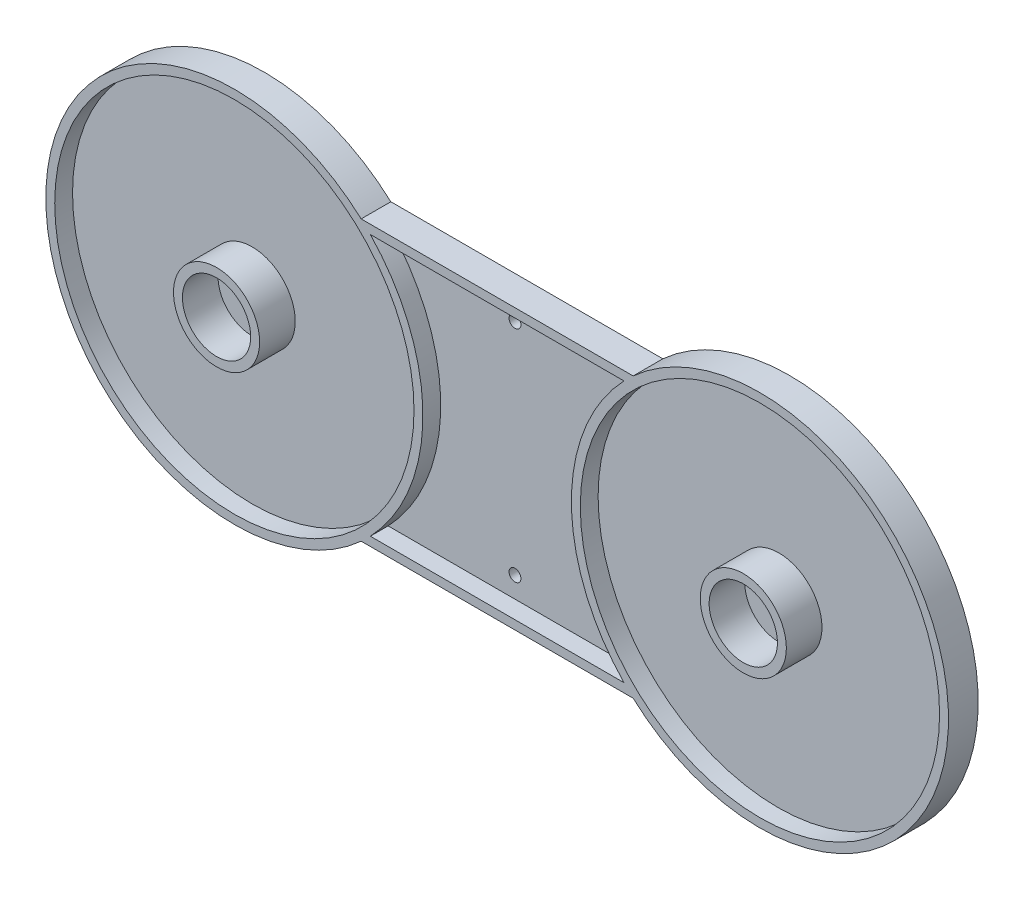
ISO-10303-21;
HEADER;
FILE_DESCRIPTION(('STEP AP214'),'2;1');
FILE_NAME('part.step','',(''),(''),'','','');
FILE_SCHEMA(('AUTOMOTIVE_DESIGN { 1 0 10303 214 1 1 1 1 }'));
ENDSEC;
DATA;
#1=APPLICATION_CONTEXT('core data for automotive mechanical design processes');
#2=APPLICATION_PROTOCOL_DEFINITION('international standard','automotive_design',2000,#1);
#3=PRODUCT_CONTEXT('',#1,'mechanical');
#4=PRODUCT('Part','Part','',(#3));
#5=PRODUCT_RELATED_PRODUCT_CATEGORY('part','',(#4));
#6=PRODUCT_DEFINITION_FORMATION('','',#4);
#7=PRODUCT_DEFINITION_CONTEXT('part definition',#1,'design');
#8=PRODUCT_DEFINITION('design','',#6,#7);
#9=PRODUCT_DEFINITION_SHAPE('','',#8);
#10=(LENGTH_UNIT() NAMED_UNIT(*) SI_UNIT(.MILLI.,.METRE.));
#11=(NAMED_UNIT(*) PLANE_ANGLE_UNIT() SI_UNIT($,.RADIAN.));
#12=(NAMED_UNIT(*) SI_UNIT($,.STERADIAN.) SOLID_ANGLE_UNIT());
#13=UNCERTAINTY_MEASURE_WITH_UNIT(LENGTH_MEASURE(1.E-05),#10,'distance_accuracy_value','');
#14=(GEOMETRIC_REPRESENTATION_CONTEXT(3) GLOBAL_UNCERTAINTY_ASSIGNED_CONTEXT((#13)) GLOBAL_UNIT_ASSIGNED_CONTEXT((#10,
#11,#12)) REPRESENTATION_CONTEXT('',''));
#15=CARTESIAN_POINT('',(0.,0.,0.));
#16=DIRECTION('',(0.,0.,1.));
#17=DIRECTION('',(1.,0.,0.));
#18=AXIS2_PLACEMENT_3D('',#15,#16,#17);
#19=CARTESIAN_POINT('',(44.25,0.,2.));
#20=DIRECTION('',(0.,0.,-1.));
#21=DIRECTION('',(-1.,0.,0.));
#22=AXIS2_PLACEMENT_3D('',#19,#20,#21);
#23=CYLINDRICAL_SURFACE('',#22,31.75);
#24=CARTESIAN_POINT('',(44.25,0.,0.));
#25=DIRECTION('',(0.,0.,1.));
#26=DIRECTION('',(1.,0.,0.));
#27=AXIS2_PLACEMENT_3D('',#24,#25,#26);
#28=CIRCLE('',#27,31.75);
#29=CARTESIAN_POINT('',(22.9002341933219,-23.5,0.));
#30=VERTEX_POINT('',#29);
#31=CARTESIAN_POINT('',(22.9002341933219,23.5,0.));
#32=VERTEX_POINT('',#31);
#33=EDGE_CURVE('E179',#30,#32,#28,.T.);
#34=ORIENTED_EDGE('',*,*,#33,.T.);
#35=DIRECTION('',(0.,0.,-1.));
#36=VECTOR('',#35,1.);
#37=CARTESIAN_POINT('',(22.9002341933219,23.5,2.));
#38=LINE('',#37,#36);
#39=CARTESIAN_POINT('',(22.9002341933219,23.5,5.));
#40=VERTEX_POINT('',#39);
#41=EDGE_CURVE('E204',#40,#32,#38,.T.);
#42=ORIENTED_EDGE('',*,*,#41,.F.);
#43=CARTESIAN_POINT('',(44.25,0.,5.));
#44=DIRECTION('',(0.,0.,1.));
#45=DIRECTION('',(1.,0.,0.));
#46=AXIS2_PLACEMENT_3D('',#43,#44,#45);
#47=CIRCLE('',#46,31.75);
#48=CARTESIAN_POINT('',(22.9002341933219,-23.5,5.));
#49=VERTEX_POINT('',#48);
#50=EDGE_CURVE('E163',#49,#40,#47,.T.);
#51=ORIENTED_EDGE('',*,*,#50,.F.);
#52=DIRECTION('',(0.,0.,-1.));
#53=VECTOR('',#52,1.);
#54=CARTESIAN_POINT('',(22.9002341933219,-23.5,2.));
#55=LINE('',#54,#53);
#56=EDGE_CURVE('E192',#49,#30,#55,.T.);
#57=ORIENTED_EDGE('',*,*,#56,.T.);
#58=EDGE_LOOP('',(#34,#42,#51,#57));
#59=FACE_BOUND('',#58,.T.);
#60=ADVANCED_FACE('F39',(#59),#23,.T.);
#61=CARTESIAN_POINT('',(22.9002341933219,23.5,2.));
#62=DIRECTION('',(0.,-1.,0.));
#63=DIRECTION('',(0.,0.,-1.));
#64=AXIS2_PLACEMENT_3D('',#61,#62,#63);
#65=PLANE('',#64);
#66=DIRECTION('',(-1.,0.,0.));
#67=VECTOR('',#66,1.);
#68=CARTESIAN_POINT('',(22.9002341933219,23.5,0.));
#69=LINE('',#68,#67);
#70=CARTESIAN_POINT('',(-22.9002341933219,23.5,0.));
#71=VERTEX_POINT('',#70);
#72=EDGE_CURVE('E183',#32,#71,#69,.T.);
#73=ORIENTED_EDGE('',*,*,#72,.T.);
#74=DIRECTION('',(0.,0.,-1.));
#75=VECTOR('',#74,1.);
#76=CARTESIAN_POINT('',(-22.9002341933219,23.5,2.));
#77=LINE('',#76,#75);
#78=CARTESIAN_POINT('',(-22.9002341933219,23.5,5.));
#79=VERTEX_POINT('',#78);
#80=EDGE_CURVE('E200',#79,#71,#77,.T.);
#81=ORIENTED_EDGE('',*,*,#80,.F.);
#82=DIRECTION('',(-1.,0.,0.));
#83=VECTOR('',#82,1.);
#84=CARTESIAN_POINT('',(22.9002341933219,23.5,5.));
#85=LINE('',#84,#83);
#86=EDGE_CURVE('E167',#40,#79,#85,.T.);
#87=ORIENTED_EDGE('',*,*,#86,.F.);
#88=ORIENTED_EDGE('',*,*,#41,.T.);
#89=EDGE_LOOP('',(#73,#81,#87,#88));
#90=FACE_BOUND('',#89,.T.);
#91=ADVANCED_FACE('F285',(#90),#65,.F.);
#92=CARTESIAN_POINT('',(-44.25,0.,2.));
#93=DIRECTION('',(0.,0.,-1.));
#94=DIRECTION('',(-1.,0.,0.));
#95=AXIS2_PLACEMENT_3D('',#92,#93,#94);
#96=CYLINDRICAL_SURFACE('',#95,31.75);
#97=CARTESIAN_POINT('',(-44.25,0.,0.));
#98=DIRECTION('',(0.,0.,1.));
#99=DIRECTION('',(1.,0.,0.));
#100=AXIS2_PLACEMENT_3D('',#97,#98,#99);
#101=CIRCLE('',#100,31.75);
#102=CARTESIAN_POINT('',(-22.9002341933219,-23.5,0.));
#103=VERTEX_POINT('',#102);
#104=EDGE_CURVE('E186',#71,#103,#101,.T.);
#105=ORIENTED_EDGE('',*,*,#104,.T.);
#106=DIRECTION('',(0.,0.,-1.));
#107=VECTOR('',#106,1.);
#108=CARTESIAN_POINT('',(-22.9002341933219,-23.5,2.));
#109=LINE('',#108,#107);
#110=CARTESIAN_POINT('',(-22.9002341933219,-23.5,5.));
#111=VERTEX_POINT('',#110);
#112=EDGE_CURVE('E196',#111,#103,#109,.T.);
#113=ORIENTED_EDGE('',*,*,#112,.F.);
#114=CARTESIAN_POINT('',(-44.25,0.,5.));
#115=DIRECTION('',(0.,0.,1.));
#116=DIRECTION('',(1.,0.,0.));
#117=AXIS2_PLACEMENT_3D('',#114,#115,#116);
#118=CIRCLE('',#117,31.75);
#119=EDGE_CURVE('E171',#79,#111,#118,.T.);
#120=ORIENTED_EDGE('',*,*,#119,.F.);
#121=ORIENTED_EDGE('',*,*,#80,.T.);
#122=EDGE_LOOP('',(#105,#113,#120,#121));
#123=FACE_BOUND('',#122,.T.);
#124=ADVANCED_FACE('F290',(#123),#96,.T.);
#125=CARTESIAN_POINT('',(22.9002341933219,-23.5,2.));
#126=DIRECTION('',(0.,1.,0.));
#127=DIRECTION('',(-1.,0.,0.));
#128=AXIS2_PLACEMENT_3D('',#125,#126,#127);
#129=PLANE('',#128);
#130=DIRECTION('',(1.,0.,0.));
#131=VECTOR('',#130,1.);
#132=CARTESIAN_POINT('',(22.9002341933219,-23.5,0.));
#133=LINE('',#132,#131);
#134=EDGE_CURVE('E189',#103,#30,#133,.T.);
#135=ORIENTED_EDGE('',*,*,#134,.T.);
#136=ORIENTED_EDGE('',*,*,#56,.F.);
#137=DIRECTION('',(1.,0.,0.));
#138=VECTOR('',#137,1.);
#139=CARTESIAN_POINT('',(-22.9002341933219,-23.5,5.));
#140=LINE('',#139,#138);
#141=EDGE_CURVE('E175',#111,#49,#140,.T.);
#142=ORIENTED_EDGE('',*,*,#141,.F.);
#143=ORIENTED_EDGE('',*,*,#112,.T.);
#144=EDGE_LOOP('',(#135,#136,#142,#143));
#145=FACE_BOUND('',#144,.T.);
#146=ADVANCED_FACE('F303',(#145),#129,.F.);
#147=CARTESIAN_POINT('',(44.25,0.,0.));
#148=DIRECTION('',(0.,0.,1.));
#149=DIRECTION('',(1.,0.,0.));
#150=AXIS2_PLACEMENT_3D('',#147,#148,#149);
#151=PLANE('',#150);
#152=CARTESIAN_POINT('',(0.,18.5,0.));
#153=DIRECTION('',(0.,0.,1.));
#154=DIRECTION('',(1.,0.,0.));
#155=AXIS2_PLACEMENT_3D('',#152,#153,#154);
#156=CIRCLE('',#155,1.);
#157=CARTESIAN_POINT('',(1.,18.5,0.));
#158=VERTEX_POINT('',#157);
#159=EDGE_CURVE('E221',#158,#158,#156,.T.);
#160=ORIENTED_EDGE('',*,*,#159,.T.);
#161=EDGE_LOOP('',(#160));
#162=FACE_BOUND('',#161,.T.);
#163=CARTESIAN_POINT('',(0.,-18.5,0.));
#164=DIRECTION('',(0.,0.,1.));
#165=DIRECTION('',(-1.,0.,0.));
#166=AXIS2_PLACEMENT_3D('',#163,#164,#165);
#167=CIRCLE('',#166,1.);
#168=CARTESIAN_POINT('',(-1.,-18.5,0.));
#169=VERTEX_POINT('',#168);
#170=EDGE_CURVE('E229',#169,#169,#167,.T.);
#171=ORIENTED_EDGE('',*,*,#170,.T.);
#172=EDGE_LOOP('',(#171));
#173=FACE_BOUND('',#172,.T.);
#174=ORIENTED_EDGE('',*,*,#33,.F.);
#175=ORIENTED_EDGE('',*,*,#134,.F.);
#176=ORIENTED_EDGE('',*,*,#104,.F.);
#177=ORIENTED_EDGE('',*,*,#72,.F.);
#178=EDGE_LOOP('',(#174,#175,#176,#177));
#179=FACE_BOUND('',#178,.T.);
#180=ADVANCED_FACE('F281',(#162,#173,#179),#151,.F.);
#181=CARTESIAN_POINT('',(44.25,0.,5.));
#182=DIRECTION('',(0.,0.,1.));
#183=DIRECTION('',(1.,0.,0.));
#184=AXIS2_PLACEMENT_3D('',#181,#182,#183);
#185=PLANE('',#184);
#186=CARTESIAN_POINT('',(-44.25,0.,5.));
#187=DIRECTION('',(0.,0.,1.));
#188=DIRECTION('',(1.,0.,0.));
#189=AXIS2_PLACEMENT_3D('',#186,#187,#188);
#190=CIRCLE('',#189,30.25);
#191=CARTESIAN_POINT('',(-14.,0.,5.));
#192=VERTEX_POINT('',#191);
#193=EDGE_CURVE('E159',#192,#192,#190,.T.);
#194=ORIENTED_EDGE('',*,*,#193,.F.);
#195=EDGE_LOOP('',(#194));
#196=FACE_BOUND('',#195,.T.);
#197=ORIENTED_EDGE('',*,*,#50,.T.);
#198=ORIENTED_EDGE('',*,*,#86,.T.);
#199=ORIENTED_EDGE('',*,*,#119,.T.);
#200=ORIENTED_EDGE('',*,*,#141,.T.);
#201=EDGE_LOOP('',(#197,#198,#199,#200));
#202=FACE_BOUND('',#201,.T.);
#203=CARTESIAN_POINT('',(44.25,0.,5.));
#204=DIRECTION('',(0.,0.,1.));
#205=DIRECTION('',(1.,0.,0.));
#206=AXIS2_PLACEMENT_3D('',#203,#204,#205);
#207=CIRCLE('',#206,30.25);
#208=CARTESIAN_POINT('',(74.5,0.,5.));
#209=VERTEX_POINT('',#208);
#210=EDGE_CURVE('E122',#209,#209,#207,.T.);
#211=ORIENTED_EDGE('',*,*,#210,.F.);
#212=EDGE_LOOP('',(#211));
#213=FACE_BOUND('',#212,.T.);
#214=DIRECTION('',(-1.,0.,0.));
#215=VECTOR('',#214,1.);
#216=CARTESIAN_POINT('',(-21.3575885935972,22.,5.));
#217=LINE('',#216,#215);
#218=CARTESIAN_POINT('',(21.3575885935972,22.,5.));
#219=VERTEX_POINT('',#218);
#220=CARTESIAN_POINT('',(-21.3575885935972,22.,5.));
#221=VERTEX_POINT('',#220);
#222=EDGE_CURVE('E115',#219,#221,#217,.T.);
#223=ORIENTED_EDGE('',*,*,#222,.F.);
#224=CARTESIAN_POINT('',(44.25,0.,5.));
#225=DIRECTION('',(0.,0.,-1.));
#226=DIRECTION('',(1.,0.,0.));
#227=AXIS2_PLACEMENT_3D('',#224,#225,#226);
#228=CIRCLE('',#227,31.75);
#229=CARTESIAN_POINT('',(21.3575885935972,-22.,5.));
#230=VERTEX_POINT('',#229);
#231=EDGE_CURVE('E105',#230,#219,#228,.T.);
#232=ORIENTED_EDGE('',*,*,#231,.F.);
#233=DIRECTION('',(1.,0.,0.));
#234=VECTOR('',#233,1.);
#235=CARTESIAN_POINT('',(-21.3575885935972,-22.,5.));
#236=LINE('',#235,#234);
#237=CARTESIAN_POINT('',(-21.3575885935972,-22.,5.));
#238=VERTEX_POINT('',#237);
#239=EDGE_CURVE('E132',#238,#230,#236,.T.);
#240=ORIENTED_EDGE('',*,*,#239,.F.);
#241=CARTESIAN_POINT('',(-44.25,0.,5.));
#242=DIRECTION('',(0.,0.,-1.));
#243=DIRECTION('',(1.,0.,0.));
#244=AXIS2_PLACEMENT_3D('',#241,#242,#243);
#245=CIRCLE('',#244,31.75);
#246=EDGE_CURVE('E128',#221,#238,#245,.T.);
#247=ORIENTED_EDGE('',*,*,#246,.F.);
#248=EDGE_LOOP('',(#223,#232,#240,#247));
#249=FACE_BOUND('',#248,.T.);
#250=ADVANCED_FACE('F126',(#196,#202,#213,#249),#185,.T.);
#251=CARTESIAN_POINT('',(-44.25,0.,5.));
#252=DIRECTION('',(0.,0.,-1.));
#253=DIRECTION('',(-1.,0.,0.));
#254=AXIS2_PLACEMENT_3D('',#251,#252,#253);
#255=CYLINDRICAL_SURFACE('',#254,30.25);
#256=ORIENTED_EDGE('',*,*,#193,.T.);
#257=EDGE_LOOP('',(#256));
#258=FACE_BOUND('',#257,.T.);
#259=CARTESIAN_POINT('',(-44.25,0.,2.));
#260=DIRECTION('',(0.,0.,1.));
#261=DIRECTION('',(1.,0.,0.));
#262=AXIS2_PLACEMENT_3D('',#259,#260,#261);
#263=CIRCLE('',#262,30.25);
#264=CARTESIAN_POINT('',(-14.,0.,2.));
#265=VERTEX_POINT('',#264);
#266=EDGE_CURVE('E212',#265,#265,#263,.F.);
#267=ORIENTED_EDGE('',*,*,#266,.T.);
#268=EDGE_LOOP('',(#267));
#269=FACE_BOUND('',#268,.T.);
#270=ADVANCED_FACE('F270',(#258,#269),#255,.F.);
#271=CARTESIAN_POINT('',(44.25,0.,5.));
#272=DIRECTION('',(0.,0.,-1.));
#273=DIRECTION('',(-1.,0.,0.));
#274=AXIS2_PLACEMENT_3D('',#271,#272,#273);
#275=CYLINDRICAL_SURFACE('',#274,30.25);
#276=ORIENTED_EDGE('',*,*,#210,.T.);
#277=EDGE_LOOP('',(#276));
#278=FACE_BOUND('',#277,.T.);
#279=CARTESIAN_POINT('',(44.25,0.,2.));
#280=DIRECTION('',(0.,0.,1.));
#281=DIRECTION('',(1.,0.,0.));
#282=AXIS2_PLACEMENT_3D('',#279,#280,#281);
#283=CIRCLE('',#282,30.25);
#284=CARTESIAN_POINT('',(74.5,0.,2.));
#285=VERTEX_POINT('',#284);
#286=EDGE_CURVE('E208',#285,#285,#283,.F.);
#287=ORIENTED_EDGE('',*,*,#286,.T.);
#288=EDGE_LOOP('',(#287));
#289=FACE_BOUND('',#288,.T.);
#290=ADVANCED_FACE('F272',(#278,#289),#275,.F.);
#291=CARTESIAN_POINT('',(44.25,0.,5.));
#292=DIRECTION('',(0.,0.,-1.));
#293=DIRECTION('',(-1.,0.,0.));
#294=AXIS2_PLACEMENT_3D('',#291,#292,#293);
#295=CYLINDRICAL_SURFACE('',#294,31.75);
#296=CARTESIAN_POINT('',(44.25,0.,2.));
#297=DIRECTION('',(0.,0.,-1.));
#298=DIRECTION('',(1.,0.,0.));
#299=AXIS2_PLACEMENT_3D('',#296,#297,#298);
#300=CIRCLE('',#299,31.75);
#301=CARTESIAN_POINT('',(21.3575885935972,-22.,2.));
#302=VERTEX_POINT('',#301);
#303=CARTESIAN_POINT('',(21.3575885935972,22.,2.));
#304=VERTEX_POINT('',#303);
#305=EDGE_CURVE('E56',#302,#304,#300,.T.);
#306=ORIENTED_EDGE('',*,*,#305,.F.);
#307=DIRECTION('',(0.,0.,-1.));
#308=VECTOR('',#307,1.);
#309=CARTESIAN_POINT('',(21.3575885935972,-22.,5.));
#310=LINE('',#309,#308);
#311=EDGE_CURVE('E110',#230,#302,#310,.T.);
#312=ORIENTED_EDGE('',*,*,#311,.F.);
#313=ORIENTED_EDGE('',*,*,#231,.T.);
#314=DIRECTION('',(0.,0.,-1.));
#315=VECTOR('',#314,1.);
#316=CARTESIAN_POINT('',(21.3575885935972,22.,5.));
#317=LINE('',#316,#315);
#318=EDGE_CURVE('E108',#219,#304,#317,.T.);
#319=ORIENTED_EDGE('',*,*,#318,.T.);
#320=EDGE_LOOP('',(#306,#312,#313,#319));
#321=FACE_BOUND('',#320,.T.);
#322=ADVANCED_FACE('F107',(#321),#295,.T.);
#323=CARTESIAN_POINT('',(-21.3575885935972,22.,5.));
#324=DIRECTION('',(0.,-1.,0.));
#325=DIRECTION('',(0.,0.,-1.));
#326=AXIS2_PLACEMENT_3D('',#323,#324,#325);
#327=PLANE('',#326);
#328=DIRECTION('',(-1.,0.,0.));
#329=VECTOR('',#328,1.);
#330=CARTESIAN_POINT('',(-21.3575885935972,22.,2.));
#331=LINE('',#330,#329);
#332=CARTESIAN_POINT('',(-21.3575885935972,22.,2.));
#333=VERTEX_POINT('',#332);
#334=EDGE_CURVE('E60',#304,#333,#331,.T.);
#335=ORIENTED_EDGE('',*,*,#334,.F.);
#336=ORIENTED_EDGE('',*,*,#318,.F.);
#337=ORIENTED_EDGE('',*,*,#222,.T.);
#338=DIRECTION('',(0.,0.,-1.));
#339=VECTOR('',#338,1.);
#340=CARTESIAN_POINT('',(-21.3575885935972,22.,5.));
#341=LINE('',#340,#339);
#342=EDGE_CURVE('E123',#221,#333,#341,.T.);
#343=ORIENTED_EDGE('',*,*,#342,.T.);
#344=EDGE_LOOP('',(#335,#336,#337,#343));
#345=FACE_BOUND('',#344,.T.);
#346=ADVANCED_FACE('F119',(#345),#327,.T.);
#347=CARTESIAN_POINT('',(-44.25,0.,5.));
#348=DIRECTION('',(0.,0.,-1.));
#349=DIRECTION('',(-1.,0.,0.));
#350=AXIS2_PLACEMENT_3D('',#347,#348,#349);
#351=CYLINDRICAL_SURFACE('',#350,31.75);
#352=CARTESIAN_POINT('',(-44.25,0.,2.));
#353=DIRECTION('',(0.,0.,-1.));
#354=DIRECTION('',(1.,0.,0.));
#355=AXIS2_PLACEMENT_3D('',#352,#353,#354);
#356=CIRCLE('',#355,31.75);
#357=CARTESIAN_POINT('',(-21.3575885935972,-22.,2.));
#358=VERTEX_POINT('',#357);
#359=EDGE_CURVE('E143',#333,#358,#356,.T.);
#360=ORIENTED_EDGE('',*,*,#359,.F.);
#361=ORIENTED_EDGE('',*,*,#342,.F.);
#362=ORIENTED_EDGE('',*,*,#246,.T.);
#363=DIRECTION('',(0.,0.,-1.));
#364=VECTOR('',#363,1.);
#365=CARTESIAN_POINT('',(-21.3575885935972,-22.,5.));
#366=LINE('',#365,#364);
#367=EDGE_CURVE('E150',#238,#358,#366,.T.);
#368=ORIENTED_EDGE('',*,*,#367,.T.);
#369=EDGE_LOOP('',(#360,#361,#362,#368));
#370=FACE_BOUND('',#369,.T.);
#371=ADVANCED_FACE('F323',(#370),#351,.T.);
#372=CARTESIAN_POINT('',(-21.3575885935972,-22.,5.));
#373=DIRECTION('',(0.,1.,0.));
#374=DIRECTION('',(-1.,0.,0.));
#375=AXIS2_PLACEMENT_3D('',#372,#373,#374);
#376=PLANE('',#375);
#377=DIRECTION('',(1.,0.,0.));
#378=VECTOR('',#377,1.);
#379=CARTESIAN_POINT('',(-21.3575885935972,-22.,2.));
#380=LINE('',#379,#378);
#381=EDGE_CURVE('E116',#358,#302,#380,.T.);
#382=ORIENTED_EDGE('',*,*,#381,.F.);
#383=ORIENTED_EDGE('',*,*,#367,.F.);
#384=ORIENTED_EDGE('',*,*,#239,.T.);
#385=ORIENTED_EDGE('',*,*,#311,.T.);
#386=EDGE_LOOP('',(#382,#383,#384,#385));
#387=FACE_BOUND('',#386,.T.);
#388=ADVANCED_FACE('F315',(#387),#376,.T.);
#389=CARTESIAN_POINT('',(44.25,0.,2.));
#390=DIRECTION('',(0.,0.,1.));
#391=DIRECTION('',(1.,0.,0.));
#392=AXIS2_PLACEMENT_3D('',#389,#390,#391);
#393=PLANE('',#392);
#394=CARTESIAN_POINT('',(0.,18.5,2.));
#395=DIRECTION('',(0.,0.,1.));
#396=DIRECTION('',(1.,0.,0.));
#397=AXIS2_PLACEMENT_3D('',#394,#395,#396);
#398=CIRCLE('',#397,1.);
#399=CARTESIAN_POINT('',(1.,18.5,2.));
#400=VERTEX_POINT('',#399);
#401=EDGE_CURVE('E42',#400,#400,#398,.F.);
#402=ORIENTED_EDGE('',*,*,#401,.T.);
#403=EDGE_LOOP('',(#402));
#404=FACE_BOUND('',#403,.T.);
#405=CARTESIAN_POINT('',(0.,-18.5,2.));
#406=DIRECTION('',(0.,0.,1.));
#407=DIRECTION('',(1.,0.,0.));
#408=AXIS2_PLACEMENT_3D('',#405,#406,#407);
#409=CIRCLE('',#408,1.);
#410=CARTESIAN_POINT('',(1.,-18.5,2.));
#411=VERTEX_POINT('',#410);
#412=EDGE_CURVE('E218',#411,#411,#409,.F.);
#413=ORIENTED_EDGE('',*,*,#412,.T.);
#414=EDGE_LOOP('',(#413));
#415=FACE_BOUND('',#414,.T.);
#416=ORIENTED_EDGE('',*,*,#305,.T.);
#417=ORIENTED_EDGE('',*,*,#334,.T.);
#418=ORIENTED_EDGE('',*,*,#359,.T.);
#419=ORIENTED_EDGE('',*,*,#381,.T.);
#420=EDGE_LOOP('',(#416,#417,#418,#419));
#421=FACE_BOUND('',#420,.T.);
#422=ADVANCED_FACE('F313',(#404,#415,#421),#393,.T.);
#423=CARTESIAN_POINT('',(44.447055654795,-0.286533560220095,2.));
#424=DIRECTION('',(0.,0.,1.));
#425=DIRECTION('',(1.,0.,0.));
#426=AXIS2_PLACEMENT_3D('',#423,#424,#425);
#427=CIRCLE('',#426,7.25);
#428=CARTESIAN_POINT('',(51.697055654795,-0.286533560220095,2.));
#429=VERTEX_POINT('',#428);
#430=EDGE_CURVE('E240',#429,#429,#427,.T.);
#431=ORIENTED_EDGE('',*,*,#430,.F.);
#432=EDGE_LOOP('',(#431));
#433=FACE_BOUND('',#432,.T.);
#434=ORIENTED_EDGE('',*,*,#286,.F.);
#435=EDGE_LOOP('',(#434));
#436=FACE_BOUND('',#435,.T.);
#437=ADVANCED_FACE('F265',(#433,#436),#393,.T.);
#438=CARTESIAN_POINT('',(-44.25,0.,2.));
#439=DIRECTION('',(0.,0.,1.));
#440=DIRECTION('',(1.,0.,0.));
#441=AXIS2_PLACEMENT_3D('',#438,#439,#440);
#442=CIRCLE('',#441,7.25);
#443=CARTESIAN_POINT('',(-37.,0.,2.));
#444=VERTEX_POINT('',#443);
#445=EDGE_CURVE('E252',#444,#444,#442,.T.);
#446=ORIENTED_EDGE('',*,*,#445,.F.);
#447=EDGE_LOOP('',(#446));
#448=FACE_BOUND('',#447,.T.);
#449=ORIENTED_EDGE('',*,*,#266,.F.);
#450=EDGE_LOOP('',(#449));
#451=FACE_BOUND('',#450,.T.);
#452=ADVANCED_FACE('F261',(#448,#451),#393,.T.);
#453=CARTESIAN_POINT('',(-44.25,0.,8.));
#454=DIRECTION('',(0.,0.,1.));
#455=DIRECTION('',(1.,0.,0.));
#456=AXIS2_PLACEMENT_3D('',#453,#454,#455);
#457=PLANE('',#456);
#458=CARTESIAN_POINT('',(-44.25,0.,8.));
#459=DIRECTION('',(0.,0.,1.));
#460=DIRECTION('',(1.,0.,0.));
#461=AXIS2_PLACEMENT_3D('',#458,#459,#460);
#462=CIRCLE('',#461,7.25);
#463=CARTESIAN_POINT('',(-37.,0.,8.));
#464=VERTEX_POINT('',#463);
#465=EDGE_CURVE('E140',#464,#464,#462,.T.);
#466=ORIENTED_EDGE('',*,*,#465,.T.);
#467=EDGE_LOOP('',(#466));
#468=FACE_BOUND('',#467,.T.);
#469=CARTESIAN_POINT('',(-44.25,0.,8.));
#470=DIRECTION('',(0.,0.,1.));
#471=DIRECTION('',(1.,0.,0.));
#472=AXIS2_PLACEMENT_3D('',#469,#470,#471);
#473=CIRCLE('',#472,5.75);
#474=CARTESIAN_POINT('',(-38.5,0.,8.));
#475=VERTEX_POINT('',#474);
#476=EDGE_CURVE('E245',#475,#475,#473,.T.);
#477=ORIENTED_EDGE('',*,*,#476,.F.);
#478=EDGE_LOOP('',(#477));
#479=FACE_BOUND('',#478,.T.);
#480=ADVANCED_FACE('F264',(#468,#479),#457,.T.);
#481=CARTESIAN_POINT('',(-44.25,0.,8.));
#482=DIRECTION('',(0.,0.,-1.));
#483=DIRECTION('',(-1.,0.,0.));
#484=AXIS2_PLACEMENT_3D('',#481,#482,#483);
#485=CYLINDRICAL_SURFACE('',#484,7.25);
#486=ORIENTED_EDGE('',*,*,#465,.F.);
#487=EDGE_LOOP('',(#486));
#488=FACE_BOUND('',#487,.T.);
#489=ORIENTED_EDGE('',*,*,#445,.T.);
#490=EDGE_LOOP('',(#489));
#491=FACE_BOUND('',#490,.T.);
#492=ADVANCED_FACE('F259',(#488,#491),#485,.T.);
#493=CARTESIAN_POINT('',(-44.25,0.,8.));
#494=DIRECTION('',(0.,0.,-1.));
#495=DIRECTION('',(-1.,0.,0.));
#496=AXIS2_PLACEMENT_3D('',#493,#494,#495);
#497=CYLINDRICAL_SURFACE('',#496,5.75);
#498=ORIENTED_EDGE('',*,*,#476,.T.);
#499=EDGE_LOOP('',(#498));
#500=FACE_BOUND('',#499,.T.);
#501=CARTESIAN_POINT('',(-44.25,0.,2.));
#502=DIRECTION('',(0.,0.,1.));
#503=DIRECTION('',(1.,0.,0.));
#504=AXIS2_PLACEMENT_3D('',#501,#502,#503);
#505=CIRCLE('',#504,5.75);
#506=CARTESIAN_POINT('',(-38.5,0.,2.));
#507=VERTEX_POINT('',#506);
#508=EDGE_CURVE('E48',#507,#507,#505,.F.);
#509=ORIENTED_EDGE('',*,*,#508,.T.);
#510=EDGE_LOOP('',(#509));
#511=FACE_BOUND('',#510,.T.);
#512=ADVANCED_FACE('F343',(#500,#511),#497,.F.);
#513=ORIENTED_EDGE('',*,*,#508,.F.);
#514=EDGE_LOOP('',(#513));
#515=FACE_BOUND('',#514,.T.);
#516=ADVANCED_FACE('F267',(#515),#393,.T.);
#517=CARTESIAN_POINT('',(44.447055654795,-0.286533560220095,8.));
#518=DIRECTION('',(0.,0.,1.));
#519=DIRECTION('',(1.,0.,0.));
#520=AXIS2_PLACEMENT_3D('',#517,#518,#519);
#521=PLANE('',#520);
#522=CARTESIAN_POINT('',(44.447055654795,-0.286533560220095,8.));
#523=DIRECTION('',(0.,0.,1.));
#524=DIRECTION('',(1.,0.,0.));
#525=AXIS2_PLACEMENT_3D('',#522,#523,#524);
#526=CIRCLE('',#525,7.25);
#527=CARTESIAN_POINT('',(51.697055654795,-0.286533560220095,8.));
#528=VERTEX_POINT('',#527);
#529=EDGE_CURVE('E241',#528,#528,#526,.T.);
#530=ORIENTED_EDGE('',*,*,#529,.T.);
#531=EDGE_LOOP('',(#530));
#532=FACE_BOUND('',#531,.T.);
#533=CARTESIAN_POINT('',(44.447055654795,-0.286533560220095,8.));
#534=DIRECTION('',(0.,0.,1.));
#535=DIRECTION('',(1.,0.,0.));
#536=AXIS2_PLACEMENT_3D('',#533,#534,#535);
#537=CIRCLE('',#536,5.75);
#538=CARTESIAN_POINT('',(50.197055654795,-0.286533560220095,8.));
#539=VERTEX_POINT('',#538);
#540=EDGE_CURVE('E227',#539,#539,#537,.T.);
#541=ORIENTED_EDGE('',*,*,#540,.F.);
#542=EDGE_LOOP('',(#541));
#543=FACE_BOUND('',#542,.T.);
#544=ADVANCED_FACE('F342',(#532,#543),#521,.T.);
#545=CARTESIAN_POINT('',(44.447055654795,-0.286533560220095,8.));
#546=DIRECTION('',(0.,0.,-1.));
#547=DIRECTION('',(-1.,0.,0.));
#548=AXIS2_PLACEMENT_3D('',#545,#546,#547);
#549=CYLINDRICAL_SURFACE('',#548,7.25);
#550=ORIENTED_EDGE('',*,*,#529,.F.);
#551=EDGE_LOOP('',(#550));
#552=FACE_BOUND('',#551,.T.);
#553=ORIENTED_EDGE('',*,*,#430,.T.);
#554=EDGE_LOOP('',(#553));
#555=FACE_BOUND('',#554,.T.);
#556=ADVANCED_FACE('F337',(#552,#555),#549,.T.);
#557=CARTESIAN_POINT('',(44.447055654795,-0.286533560220095,8.));
#558=DIRECTION('',(0.,0.,-1.));
#559=DIRECTION('',(-1.,0.,0.));
#560=AXIS2_PLACEMENT_3D('',#557,#558,#559);
#561=CYLINDRICAL_SURFACE('',#560,5.75);
#562=ORIENTED_EDGE('',*,*,#540,.T.);
#563=EDGE_LOOP('',(#562));
#564=FACE_BOUND('',#563,.T.);
#565=CARTESIAN_POINT('',(44.447055654795,-0.286533560220095,2.));
#566=DIRECTION('',(0.,0.,1.));
#567=DIRECTION('',(1.,0.,0.));
#568=AXIS2_PLACEMENT_3D('',#565,#566,#567);
#569=CIRCLE('',#568,5.75);
#570=CARTESIAN_POINT('',(50.197055654795,-0.286533560220095,2.));
#571=VERTEX_POINT('',#570);
#572=EDGE_CURVE('E11',#571,#571,#569,.F.);
#573=ORIENTED_EDGE('',*,*,#572,.T.);
#574=EDGE_LOOP('',(#573));
#575=FACE_BOUND('',#574,.T.);
#576=ADVANCED_FACE('F328',(#564,#575),#561,.F.);
#577=ORIENTED_EDGE('',*,*,#572,.F.);
#578=EDGE_LOOP('',(#577));
#579=FACE_BOUND('',#578,.T.);
#580=ADVANCED_FACE('F317',(#579),#393,.T.);
#581=CARTESIAN_POINT('',(0.,-18.5,12.));
#582=DIRECTION('',(0.,0.,-1.));
#583=DIRECTION('',(-1.,0.,0.));
#584=AXIS2_PLACEMENT_3D('',#581,#582,#583);
#585=CYLINDRICAL_SURFACE('',#584,1.);
#586=ORIENTED_EDGE('',*,*,#412,.F.);
#587=EDGE_LOOP('',(#586));
#588=FACE_BOUND('',#587,.T.);
#589=ORIENTED_EDGE('',*,*,#170,.F.);
#590=EDGE_LOOP('',(#589));
#591=FACE_BOUND('',#590,.T.);
#592=ADVANCED_FACE('F327',(#588,#591),#585,.F.);
#593=CARTESIAN_POINT('',(0.,18.5,12.));
#594=DIRECTION('',(0.,0.,-1.));
#595=DIRECTION('',(-1.,0.,0.));
#596=AXIS2_PLACEMENT_3D('',#593,#594,#595);
#597=CYLINDRICAL_SURFACE('',#596,1.);
#598=ORIENTED_EDGE('',*,*,#401,.F.);
#599=EDGE_LOOP('',(#598));
#600=FACE_BOUND('',#599,.T.);
#601=ORIENTED_EDGE('',*,*,#159,.F.);
#602=EDGE_LOOP('',(#601));
#603=FACE_BOUND('',#602,.T.);
#604=ADVANCED_FACE('F334',(#600,#603),#597,.F.);
#605=CLOSED_SHELL('',(#60,#91,#124,#146,#180,#250,#270,#290,#322,#346,#371,#388,#422,#437,#452,
#480,#492,#512,#516,#544,#556,#576,#580,#592,#604));
#606=MANIFOLD_SOLID_BREP('B2',#605);
#607=ADVANCED_BREP_SHAPE_REPRESENTATION('',(#18,#606),#14);
#608=SHAPE_DEFINITION_REPRESENTATION(#9,#607);
ENDSEC;
END-ISO-10303-21;
